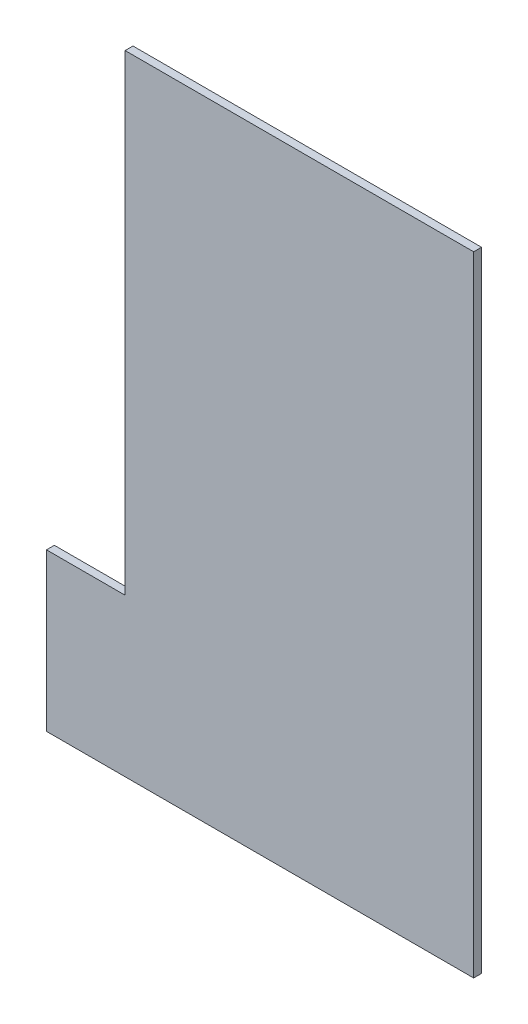
ISO-10303-21;
HEADER;
FILE_DESCRIPTION(('STEP AP214'),'2;1');
FILE_NAME('part.step','',(''),(''),'','','');
FILE_SCHEMA(('AUTOMOTIVE_DESIGN { 1 0 10303 214 1 1 1 1 }'));
ENDSEC;
DATA;
#1=APPLICATION_CONTEXT('core data for automotive mechanical design processes');
#2=APPLICATION_PROTOCOL_DEFINITION('international standard','automotive_design',2000,#1);
#3=PRODUCT_CONTEXT('',#1,'mechanical');
#4=PRODUCT('Part','Part','',(#3));
#5=PRODUCT_RELATED_PRODUCT_CATEGORY('part','',(#4));
#6=PRODUCT_DEFINITION_FORMATION('','',#4);
#7=PRODUCT_DEFINITION_CONTEXT('part definition',#1,'design');
#8=PRODUCT_DEFINITION('design','',#6,#7);
#9=PRODUCT_DEFINITION_SHAPE('','',#8);
#10=(LENGTH_UNIT() NAMED_UNIT(*) SI_UNIT(.MILLI.,.METRE.));
#11=(NAMED_UNIT(*) PLANE_ANGLE_UNIT() SI_UNIT($,.RADIAN.));
#12=(NAMED_UNIT(*) SI_UNIT($,.STERADIAN.) SOLID_ANGLE_UNIT());
#13=UNCERTAINTY_MEASURE_WITH_UNIT(LENGTH_MEASURE(1.E-05),#10,'distance_accuracy_value','');
#14=(GEOMETRIC_REPRESENTATION_CONTEXT(3) GLOBAL_UNCERTAINTY_ASSIGNED_CONTEXT((#13)) GLOBAL_UNIT_ASSIGNED_CONTEXT((#10,
#11,#12)) REPRESENTATION_CONTEXT('',''));
#15=CARTESIAN_POINT('',(0.,0.,0.));
#16=DIRECTION('',(0.,0.,1.));
#17=DIRECTION('',(1.,0.,0.));
#18=AXIS2_PLACEMENT_3D('',#15,#16,#17);
#19=CARTESIAN_POINT('',(-62.9102323402438,49.3172588832487,3.));
#20=DIRECTION('',(1.,0.,0.));
#21=DIRECTION('',(0.,1.,0.));
#22=AXIS2_PLACEMENT_3D('',#19,#20,#21);
#23=PLANE('',#22);
#24=DIRECTION('',(0.,-1.,0.));
#25=VECTOR('',#24,1.);
#26=CARTESIAN_POINT('',(-62.9102323402438,49.3172588832487,0.));
#27=LINE('',#26,#25);
#28=CARTESIAN_POINT('',(-62.9102323402438,49.3172588832487,0.));
#29=VERTEX_POINT('',#28);
#30=CARTESIAN_POINT('',(-62.9102323402438,-130.682741116751,0.));
#31=VERTEX_POINT('',#30);
#32=EDGE_CURVE('E116',#29,#31,#27,.T.);
#33=ORIENTED_EDGE('',*,*,#32,.T.);
#34=DIRECTION('',(0.,0.,-1.));
#35=VECTOR('',#34,1.);
#36=CARTESIAN_POINT('',(-62.9102323402438,-130.682741116751,3.));
#37=LINE('',#36,#35);
#38=CARTESIAN_POINT('',(-62.9102323402438,-130.682741116751,3.));
#39=VERTEX_POINT('',#38);
#40=EDGE_CURVE('E11',#39,#31,#37,.T.);
#41=ORIENTED_EDGE('',*,*,#40,.F.);
#42=DIRECTION('',(0.,-1.,0.));
#43=VECTOR('',#42,1.);
#44=CARTESIAN_POINT('',(-62.9102323402438,49.3172588832487,3.));
#45=LINE('',#44,#43);
#46=CARTESIAN_POINT('',(-62.9102323402438,49.3172588832487,3.));
#47=VERTEX_POINT('',#46);
#48=EDGE_CURVE('E127',#47,#39,#45,.T.);
#49=ORIENTED_EDGE('',*,*,#48,.F.);
#50=DIRECTION('',(0.,0.,-1.));
#51=VECTOR('',#50,1.);
#52=CARTESIAN_POINT('',(-62.9102323402438,49.3172588832487,3.));
#53=LINE('',#52,#51);
#54=EDGE_CURVE('E112',#47,#29,#53,.T.);
#55=ORIENTED_EDGE('',*,*,#54,.T.);
#56=EDGE_LOOP('',(#33,#41,#49,#55));
#57=FACE_BOUND('',#56,.T.);
#58=ADVANCED_FACE('F33',(#57),#23,.F.);
#59=CARTESIAN_POINT('',(-62.9102323402438,-130.682741116751,3.));
#60=DIRECTION('',(0.,-1.,0.));
#61=DIRECTION('',(0.,0.,-1.));
#62=AXIS2_PLACEMENT_3D('',#59,#60,#61);
#63=PLANE('',#62);
#64=DIRECTION('',(-1.,0.,0.));
#65=VECTOR('',#64,1.);
#66=CARTESIAN_POINT('',(-62.9102323402438,-130.682741116751,0.));
#67=LINE('',#66,#65);
#68=CARTESIAN_POINT('',(-92.9102323402438,-130.682741116751,0.));
#69=VERTEX_POINT('',#68);
#70=EDGE_CURVE('E119',#31,#69,#67,.T.);
#71=ORIENTED_EDGE('',*,*,#70,.T.);
#72=DIRECTION('',(0.,0.,-1.));
#73=VECTOR('',#72,1.);
#74=CARTESIAN_POINT('',(-92.9102323402438,-130.682741116751,3.));
#75=LINE('',#74,#73);
#76=CARTESIAN_POINT('',(-92.9102323402438,-130.682741116751,3.));
#77=VERTEX_POINT('',#76);
#78=EDGE_CURVE('E41',#77,#69,#75,.T.);
#79=ORIENTED_EDGE('',*,*,#78,.F.);
#80=DIRECTION('',(-1.,0.,0.));
#81=VECTOR('',#80,1.);
#82=CARTESIAN_POINT('',(-62.9102323402438,-130.682741116751,3.));
#83=LINE('',#82,#81);
#84=EDGE_CURVE('E86',#39,#77,#83,.T.);
#85=ORIENTED_EDGE('',*,*,#84,.F.);
#86=ORIENTED_EDGE('',*,*,#40,.T.);
#87=EDGE_LOOP('',(#71,#79,#85,#86));
#88=FACE_BOUND('',#87,.T.);
#89=ADVANCED_FACE('F151',(#88),#63,.F.);
#90=CARTESIAN_POINT('',(-92.9102323402438,-190.682741116751,3.));
#91=DIRECTION('',(1.,0.,0.));
#92=DIRECTION('',(0.,0.,-1.));
#93=AXIS2_PLACEMENT_3D('',#90,#91,#92);
#94=PLANE('',#93);
#95=DIRECTION('',(0.,-1.,0.));
#96=VECTOR('',#95,1.);
#97=CARTESIAN_POINT('',(-92.9102323402438,-190.682741116751,0.));
#98=LINE('',#97,#96);
#99=CARTESIAN_POINT('',(-92.9102323402438,-190.682741116751,0.));
#100=VERTEX_POINT('',#99);
#101=EDGE_CURVE('E121',#69,#100,#98,.T.);
#102=ORIENTED_EDGE('',*,*,#101,.T.);
#103=DIRECTION('',(0.,0.,-1.));
#104=VECTOR('',#103,1.);
#105=CARTESIAN_POINT('',(-92.9102323402438,-190.682741116751,3.));
#106=LINE('',#105,#104);
#107=CARTESIAN_POINT('',(-92.9102323402438,-190.682741116751,3.));
#108=VERTEX_POINT('',#107);
#109=EDGE_CURVE('E107',#108,#100,#106,.T.);
#110=ORIENTED_EDGE('',*,*,#109,.F.);
#111=DIRECTION('',(0.,-1.,0.));
#112=VECTOR('',#111,1.);
#113=CARTESIAN_POINT('',(-92.9102323402438,-190.682741116751,3.));
#114=LINE('',#113,#112);
#115=EDGE_CURVE('E99',#77,#108,#114,.T.);
#116=ORIENTED_EDGE('',*,*,#115,.F.);
#117=ORIENTED_EDGE('',*,*,#78,.T.);
#118=EDGE_LOOP('',(#102,#110,#116,#117));
#119=FACE_BOUND('',#118,.T.);
#120=ADVANCED_FACE('F133',(#119),#94,.F.);
#121=CARTESIAN_POINT('',(-62.9102323402438,-190.682741116751,3.));
#122=DIRECTION('',(0.,1.,0.));
#123=DIRECTION('',(0.,0.,1.));
#124=AXIS2_PLACEMENT_3D('',#121,#122,#123);
#125=PLANE('',#124);
#126=DIRECTION('',(1.,0.,0.));
#127=VECTOR('',#126,1.);
#128=CARTESIAN_POINT('',(-62.9102323402438,-190.682741116751,0.));
#129=LINE('',#128,#127);
#130=CARTESIAN_POINT('',(70.0897676597562,-190.682741116751,0.));
#131=VERTEX_POINT('',#130);
#132=EDGE_CURVE('E106',#100,#131,#129,.T.);
#133=ORIENTED_EDGE('',*,*,#132,.T.);
#134=DIRECTION('',(0.,0.,-1.));
#135=VECTOR('',#134,1.);
#136=CARTESIAN_POINT('',(70.0897676597562,-190.682741116751,3.));
#137=LINE('',#136,#135);
#138=CARTESIAN_POINT('',(70.0897676597562,-190.682741116751,3.));
#139=VERTEX_POINT('',#138);
#140=EDGE_CURVE('E104',#139,#131,#137,.T.);
#141=ORIENTED_EDGE('',*,*,#140,.F.);
#142=DIRECTION('',(1.,0.,0.));
#143=VECTOR('',#142,1.);
#144=CARTESIAN_POINT('',(-62.9102323402438,-190.682741116751,3.));
#145=LINE('',#144,#143);
#146=EDGE_CURVE('E93',#108,#139,#145,.T.);
#147=ORIENTED_EDGE('',*,*,#146,.F.);
#148=ORIENTED_EDGE('',*,*,#109,.T.);
#149=EDGE_LOOP('',(#133,#141,#147,#148));
#150=FACE_BOUND('',#149,.T.);
#151=ADVANCED_FACE('F105',(#150),#125,.F.);
#152=CARTESIAN_POINT('',(70.0897676597562,49.3172588832487,3.));
#153=DIRECTION('',(-1.,0.,0.));
#154=DIRECTION('',(0.,-1.,0.));
#155=AXIS2_PLACEMENT_3D('',#152,#153,#154);
#156=PLANE('',#155);
#157=DIRECTION('',(0.,1.,0.));
#158=VECTOR('',#157,1.);
#159=CARTESIAN_POINT('',(70.0897676597562,49.3172588832487,0.));
#160=LINE('',#159,#158);
#161=CARTESIAN_POINT('',(70.0897676597562,49.3172588832487,0.));
#162=VERTEX_POINT('',#161);
#163=EDGE_CURVE('E72',#131,#162,#160,.T.);
#164=ORIENTED_EDGE('',*,*,#163,.T.);
#165=DIRECTION('',(0.,0.,-1.));
#166=VECTOR('',#165,1.);
#167=CARTESIAN_POINT('',(70.0897676597562,49.3172588832487,3.));
#168=LINE('',#167,#166);
#169=CARTESIAN_POINT('',(70.0897676597562,49.3172588832487,3.));
#170=VERTEX_POINT('',#169);
#171=EDGE_CURVE('E108',#170,#162,#168,.T.);
#172=ORIENTED_EDGE('',*,*,#171,.F.);
#173=DIRECTION('',(0.,1.,0.));
#174=VECTOR('',#173,1.);
#175=CARTESIAN_POINT('',(70.0897676597562,49.3172588832487,3.));
#176=LINE('',#175,#174);
#177=EDGE_CURVE('E97',#139,#170,#176,.T.);
#178=ORIENTED_EDGE('',*,*,#177,.F.);
#179=ORIENTED_EDGE('',*,*,#140,.T.);
#180=EDGE_LOOP('',(#164,#172,#178,#179));
#181=FACE_BOUND('',#180,.T.);
#182=ADVANCED_FACE('F110',(#181),#156,.F.);
#183=CARTESIAN_POINT('',(-62.9102323402438,49.3172588832487,3.));
#184=DIRECTION('',(0.,-1.,0.));
#185=DIRECTION('',(0.,0.,-1.));
#186=AXIS2_PLACEMENT_3D('',#183,#184,#185);
#187=PLANE('',#186);
#188=DIRECTION('',(-1.,0.,0.));
#189=VECTOR('',#188,1.);
#190=CARTESIAN_POINT('',(-62.9102323402438,49.3172588832487,0.));
#191=LINE('',#190,#189);
#192=EDGE_CURVE('E78',#162,#29,#191,.T.);
#193=ORIENTED_EDGE('',*,*,#192,.T.);
#194=ORIENTED_EDGE('',*,*,#54,.F.);
#195=DIRECTION('',(-1.,0.,0.));
#196=VECTOR('',#195,1.);
#197=CARTESIAN_POINT('',(-62.9102323402438,49.3172588832487,3.));
#198=LINE('',#197,#196);
#199=EDGE_CURVE('E49',#170,#47,#198,.T.);
#200=ORIENTED_EDGE('',*,*,#199,.F.);
#201=ORIENTED_EDGE('',*,*,#171,.T.);
#202=EDGE_LOOP('',(#193,#194,#200,#201));
#203=FACE_BOUND('',#202,.T.);
#204=ADVANCED_FACE('F140',(#203),#187,.F.);
#205=CARTESIAN_POINT('',(0.,0.,3.));
#206=DIRECTION('',(0.,0.,-1.));
#207=DIRECTION('',(-1.,0.,0.));
#208=AXIS2_PLACEMENT_3D('',#205,#206,#207);
#209=PLANE('',#208);
#210=ORIENTED_EDGE('',*,*,#48,.T.);
#211=ORIENTED_EDGE('',*,*,#84,.T.);
#212=ORIENTED_EDGE('',*,*,#115,.T.);
#213=ORIENTED_EDGE('',*,*,#146,.T.);
#214=ORIENTED_EDGE('',*,*,#177,.T.);
#215=ORIENTED_EDGE('',*,*,#199,.T.);
#216=EDGE_LOOP('',(#210,#211,#212,#213,#214,#215));
#217=FACE_BOUND('',#216,.T.);
#218=ADVANCED_FACE('F95',(#217),#209,.F.);
#219=CARTESIAN_POINT('',(0.,0.,0.));
#220=DIRECTION('',(0.,0.,-1.));
#221=DIRECTION('',(-1.,0.,0.));
#222=AXIS2_PLACEMENT_3D('',#219,#220,#221);
#223=PLANE('',#222);
#224=ORIENTED_EDGE('',*,*,#32,.F.);
#225=ORIENTED_EDGE('',*,*,#192,.F.);
#226=ORIENTED_EDGE('',*,*,#163,.F.);
#227=ORIENTED_EDGE('',*,*,#132,.F.);
#228=ORIENTED_EDGE('',*,*,#101,.F.);
#229=ORIENTED_EDGE('',*,*,#70,.F.);
#230=EDGE_LOOP('',(#224,#225,#226,#227,#228,#229));
#231=FACE_BOUND('',#230,.T.);
#232=ADVANCED_FACE('F136',(#231),#223,.T.);
#233=CLOSED_SHELL('',(#58,#89,#120,#151,#182,#204,#218,#232));
#234=MANIFOLD_SOLID_BREP('B2',#233);
#235=ADVANCED_BREP_SHAPE_REPRESENTATION('',(#18,#234),#14);
#236=SHAPE_DEFINITION_REPRESENTATION(#9,#235);
ENDSEC;
END-ISO-10303-21;
